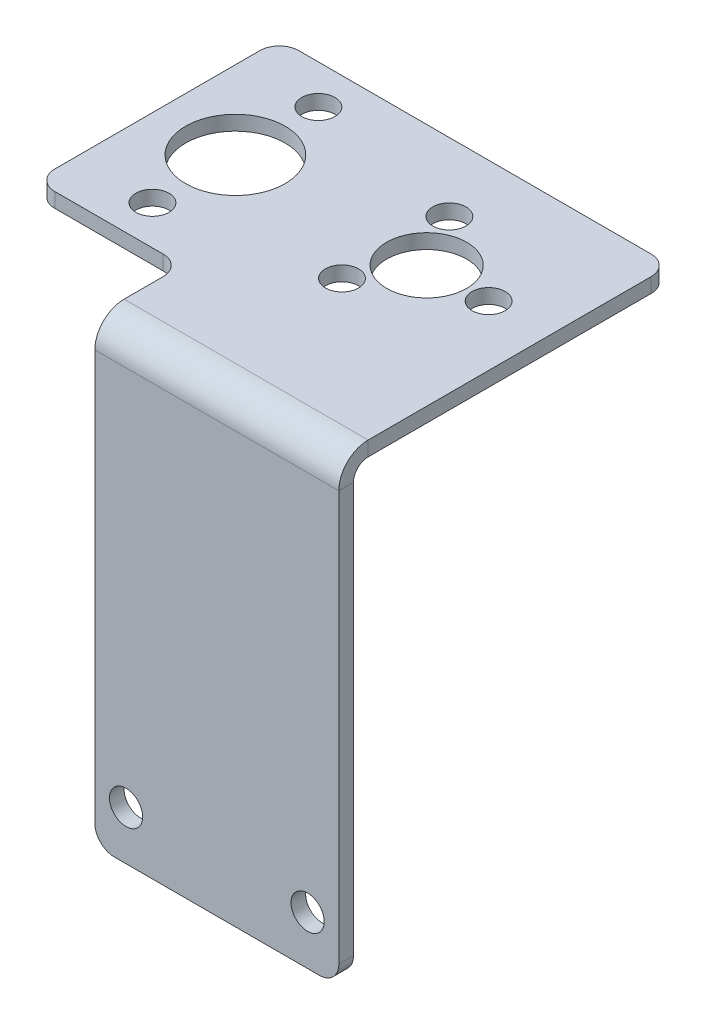
ISO-10303-21;
HEADER;
FILE_DESCRIPTION(('STEP AP214'),'2;1');
FILE_NAME('part.step','',(''),(''),'','','');
FILE_SCHEMA(('AUTOMOTIVE_DESIGN { 1 0 10303 214 1 1 1 1 }'));
ENDSEC;
DATA;
#1=APPLICATION_CONTEXT('core data for automotive mechanical design processes');
#2=APPLICATION_PROTOCOL_DEFINITION('international standard','automotive_design',2000,#1);
#3=PRODUCT_CONTEXT('',#1,'mechanical');
#4=PRODUCT('Part','Part','',(#3));
#5=PRODUCT_RELATED_PRODUCT_CATEGORY('part','',(#4));
#6=PRODUCT_DEFINITION_FORMATION('','',#4);
#7=PRODUCT_DEFINITION_CONTEXT('part definition',#1,'design');
#8=PRODUCT_DEFINITION('design','',#6,#7);
#9=PRODUCT_DEFINITION_SHAPE('','',#8);
#10=(LENGTH_UNIT() NAMED_UNIT(*) SI_UNIT(.MILLI.,.METRE.));
#11=(NAMED_UNIT(*) PLANE_ANGLE_UNIT() SI_UNIT($,.RADIAN.));
#12=(NAMED_UNIT(*) SI_UNIT($,.STERADIAN.) SOLID_ANGLE_UNIT());
#13=UNCERTAINTY_MEASURE_WITH_UNIT(LENGTH_MEASURE(1.E-05),#10,'distance_accuracy_value','');
#14=(GEOMETRIC_REPRESENTATION_CONTEXT(3) GLOBAL_UNCERTAINTY_ASSIGNED_CONTEXT((#13)) GLOBAL_UNIT_ASSIGNED_CONTEXT((#10,
#11,#12)) REPRESENTATION_CONTEXT('',''));
#15=CARTESIAN_POINT('',(0.,0.,0.));
#16=DIRECTION('',(0.,0.,1.));
#17=DIRECTION('',(1.,0.,0.));
#18=AXIS2_PLACEMENT_3D('',#15,#16,#17);
#19=CARTESIAN_POINT('',(0.,-1.5,12.5));
#20=DIRECTION('',(0.,1.,0.));
#21=DIRECTION('',(0.,0.,1.));
#22=AXIS2_PLACEMENT_3D('',#19,#20,#21);
#23=PLANE('',#22);
#24=CARTESIAN_POINT('',(7.99999999999995,-1.5,1.48453871499136E-12));
#25=DIRECTION('',(0.,1.,0.));
#26=DIRECTION('',(0.,0.,1.));
#27=AXIS2_PLACEMENT_3D('',#24,#25,#26);
#28=CIRCLE('',#27,5.1);
#29=CARTESIAN_POINT('',(7.99999999999995,-1.5,5.10000000000149));
#30=VERTEX_POINT('',#29);
#31=EDGE_CURVE('E291',#30,#30,#28,.T.);
#32=ORIENTED_EDGE('',*,*,#31,.T.);
#33=EDGE_LOOP('',(#32));
#34=FACE_BOUND('',#33,.T.);
#35=CARTESIAN_POINT('',(27.597,-1.5,1.51267887105178E-12));
#36=DIRECTION('',(0.,1.,0.));
#37=DIRECTION('',(0.,0.,1.));
#38=AXIS2_PLACEMENT_3D('',#35,#36,#37);
#39=CIRCLE('',#38,4.1);
#40=CARTESIAN_POINT('',(27.597,-1.5,4.10000000000151));
#41=VERTEX_POINT('',#40);
#42=EDGE_CURVE('E300',#41,#41,#39,.T.);
#43=ORIENTED_EDGE('',*,*,#42,.T.);
#44=EDGE_LOOP('',(#43));
#45=FACE_BOUND('',#44,.T.);
#46=CARTESIAN_POINT('',(24.422,-1.5,5.49926131403269));
#47=DIRECTION('',(0.,-1.,0.));
#48=DIRECTION('',(0.,0.,-1.));
#49=AXIS2_PLACEMENT_3D('',#46,#47,#48);
#50=CIRCLE('',#49,1.69999999999999);
#51=CARTESIAN_POINT('',(24.422,-1.5,3.79926131403271));
#52=VERTEX_POINT('',#51);
#53=EDGE_CURVE('E295',#52,#52,#50,.T.);
#54=ORIENTED_EDGE('',*,*,#53,.F.);
#55=EDGE_LOOP('',(#54));
#56=FACE_BOUND('',#55,.T.);
#57=CARTESIAN_POINT('',(33.947,-1.5,1.5204861609582E-12));
#58=DIRECTION('',(0.,-1.,0.));
#59=DIRECTION('',(0.,0.,-1.));
#60=AXIS2_PLACEMENT_3D('',#57,#58,#59);
#61=CIRCLE('',#60,1.69999999999999);
#62=CARTESIAN_POINT('',(33.947,-1.5,-1.69999999999847));
#63=VERTEX_POINT('',#62);
#64=EDGE_CURVE('E314',#63,#63,#61,.T.);
#65=ORIENTED_EDGE('',*,*,#64,.F.);
#66=EDGE_LOOP('',(#65));
#67=FACE_BOUND('',#66,.T.);
#68=CARTESIAN_POINT('',(24.4220000000001,-1.5,-5.49926131402969));
#69=DIRECTION('',(0.,-1.,0.));
#70=DIRECTION('',(0.,0.,-1.));
#71=AXIS2_PLACEMENT_3D('',#68,#69,#70);
#72=CIRCLE('',#71,1.69999999999999);
#73=CARTESIAN_POINT('',(24.4220000000001,-1.5,-7.19926131402968));
#74=VERTEX_POINT('',#73);
#75=EDGE_CURVE('E322',#74,#74,#72,.T.);
#76=ORIENTED_EDGE('',*,*,#75,.F.);
#77=EDGE_LOOP('',(#76));
#78=FACE_BOUND('',#77,.T.);
#79=CARTESIAN_POINT('',(7.99999999999995,-1.5,8.50000000000149));
#80=DIRECTION('',(0.,-1.,0.));
#81=DIRECTION('',(0.,0.,-1.));
#82=AXIS2_PLACEMENT_3D('',#79,#80,#81);
#83=CIRCLE('',#82,1.69999999999999);
#84=CARTESIAN_POINT('',(7.99999999999995,-1.5,6.8000000000015));
#85=VERTEX_POINT('',#84);
#86=EDGE_CURVE('E330',#85,#85,#83,.T.);
#87=ORIENTED_EDGE('',*,*,#86,.F.);
#88=EDGE_LOOP('',(#87));
#89=FACE_BOUND('',#88,.T.);
#90=CARTESIAN_POINT('',(7.99999999999995,-1.5,-8.49999999999852));
#91=DIRECTION('',(0.,-1.,0.));
#92=DIRECTION('',(0.,0.,-1.));
#93=AXIS2_PLACEMENT_3D('',#90,#91,#92);
#94=CIRCLE('',#93,1.69999999999999);
#95=CARTESIAN_POINT('',(7.99999999999995,-1.5,-10.1999999999985));
#96=VERTEX_POINT('',#95);
#97=EDGE_CURVE('E338',#96,#96,#94,.T.);
#98=ORIENTED_EDGE('',*,*,#97,.F.);
#99=EDGE_LOOP('',(#98));
#100=FACE_BOUND('',#99,.T.);
#101=DIRECTION('',(1.,0.,0.));
#102=VECTOR('',#101,1.);
#103=CARTESIAN_POINT('',(0.,-1.5,-12.5));
#104=LINE('',#103,#102);
#105=CARTESIAN_POINT('',(2.,-1.5,-12.5));
#106=VERTEX_POINT('',#105);
#107=CARTESIAN_POINT('',(38.1,-1.5,-12.5));
#108=VERTEX_POINT('',#107);
#109=EDGE_CURVE('E346',#106,#108,#104,.T.);
#110=ORIENTED_EDGE('',*,*,#109,.T.);
#111=CARTESIAN_POINT('',(38.1,-1.5,-10.5));
#112=DIRECTION('',(0.,1.,0.));
#113=DIRECTION('',(0.,0.,1.));
#114=AXIS2_PLACEMENT_3D('',#111,#112,#113);
#115=CIRCLE('',#114,2.);
#116=CARTESIAN_POINT('',(40.1,-1.5,-10.5));
#117=VERTEX_POINT('',#116);
#118=EDGE_CURVE('E394',#108,#117,#115,.F.);
#119=ORIENTED_EDGE('',*,*,#118,.T.);
#120=DIRECTION('',(0.,0.,-1.));
#121=VECTOR('',#120,1.);
#122=CARTESIAN_POINT('',(40.1,-1.5,18.5));
#123=LINE('',#122,#121);
#124=CARTESIAN_POINT('',(40.1,-1.5,18.5));
#125=VERTEX_POINT('',#124);
#126=EDGE_CURVE('E271',#125,#117,#123,.T.);
#127=ORIENTED_EDGE('',*,*,#126,.F.);
#128=DIRECTION('',(-1.,0.,0.));
#129=VECTOR('',#128,1.);
#130=CARTESIAN_POINT('',(15.1,-1.5,18.5));
#131=LINE('',#130,#129);
#132=CARTESIAN_POINT('',(15.1,-1.5,18.5));
#133=VERTEX_POINT('',#132);
#134=EDGE_CURVE('E262',#133,#125,#131,.F.);
#135=ORIENTED_EDGE('',*,*,#134,.F.);
#136=DIRECTION('',(0.,0.,-1.));
#137=VECTOR('',#136,1.);
#138=CARTESIAN_POINT('',(15.1,-1.5,18.5));
#139=LINE('',#138,#137);
#140=CARTESIAN_POINT('',(15.1,-1.5,14.5));
#141=VERTEX_POINT('',#140);
#142=EDGE_CURVE('E283',#133,#141,#139,.T.);
#143=ORIENTED_EDGE('',*,*,#142,.T.);
#144=CARTESIAN_POINT('',(13.1,-1.5,14.5));
#145=DIRECTION('',(0.,1.,0.));
#146=DIRECTION('',(0.,0.,1.));
#147=AXIS2_PLACEMENT_3D('',#144,#145,#146);
#148=CIRCLE('',#147,2.);
#149=CARTESIAN_POINT('',(13.1,-1.5,12.5));
#150=VERTEX_POINT('',#149);
#151=EDGE_CURVE('E13',#141,#150,#148,.T.);
#152=ORIENTED_EDGE('',*,*,#151,.T.);
#153=DIRECTION('',(1.,0.,0.));
#154=VECTOR('',#153,1.);
#155=CARTESIAN_POINT('',(0.,-1.5,12.5));
#156=LINE('',#155,#154);
#157=CARTESIAN_POINT('',(2.,-1.5,12.5));
#158=VERTEX_POINT('',#157);
#159=EDGE_CURVE('E347',#158,#150,#156,.T.);
#160=ORIENTED_EDGE('',*,*,#159,.F.);
#161=CARTESIAN_POINT('',(2.,-1.5,10.5));
#162=DIRECTION('',(0.,1.,0.));
#163=DIRECTION('',(0.,0.,1.));
#164=AXIS2_PLACEMENT_3D('',#161,#162,#163);
#165=CIRCLE('',#164,2.);
#166=CARTESIAN_POINT('',(0.,-1.5,10.5));
#167=VERTEX_POINT('',#166);
#168=EDGE_CURVE('E388',#158,#167,#165,.F.);
#169=ORIENTED_EDGE('',*,*,#168,.T.);
#170=DIRECTION('',(0.,0.,-1.));
#171=VECTOR('',#170,1.);
#172=CARTESIAN_POINT('',(0.,-1.5,12.5));
#173=LINE('',#172,#171);
#174=CARTESIAN_POINT('',(0.,-1.5,-10.5));
#175=VERTEX_POINT('',#174);
#176=EDGE_CURVE('E356',#167,#175,#173,.T.);
#177=ORIENTED_EDGE('',*,*,#176,.T.);
#178=CARTESIAN_POINT('',(2.,-1.5,-10.5));
#179=DIRECTION('',(0.,1.,0.));
#180=DIRECTION('',(0.,0.,1.));
#181=AXIS2_PLACEMENT_3D('',#178,#179,#180);
#182=CIRCLE('',#181,2.);
#183=EDGE_CURVE('E391',#175,#106,#182,.F.);
#184=ORIENTED_EDGE('',*,*,#183,.T.);
#185=EDGE_LOOP('',(#110,#119,#127,#135,#143,#152,#160,#169,#177,#184));
#186=FACE_BOUND('',#185,.T.);
#187=ADVANCED_FACE('F61',(#34,#45,#56,#67,#78,#89,#100,#186),#23,.F.);
#188=CARTESIAN_POINT('',(0.,0.,12.5));
#189=DIRECTION('',(0.,1.,0.));
#190=DIRECTION('',(0.,0.,1.));
#191=AXIS2_PLACEMENT_3D('',#188,#189,#190);
#192=PLANE('',#191);
#193=DIRECTION('',(0.,0.,-1.));
#194=VECTOR('',#193,1.);
#195=CARTESIAN_POINT('',(40.1,0.,18.5));
#196=LINE('',#195,#194);
#197=CARTESIAN_POINT('',(40.1,0.,18.5));
#198=VERTEX_POINT('',#197);
#199=CARTESIAN_POINT('',(40.1,0.,-10.5));
#200=VERTEX_POINT('',#199);
#201=EDGE_CURVE('E275',#198,#200,#196,.T.);
#202=ORIENTED_EDGE('',*,*,#201,.T.);
#203=CARTESIAN_POINT('',(38.1,0.,-10.5));
#204=DIRECTION('',(0.,1.,0.));
#205=DIRECTION('',(0.,0.,1.));
#206=AXIS2_PLACEMENT_3D('',#203,#204,#205);
#207=CIRCLE('',#206,2.);
#208=CARTESIAN_POINT('',(38.1,0.,-12.5));
#209=VERTEX_POINT('',#208);
#210=EDGE_CURVE('E379',#200,#209,#207,.T.);
#211=ORIENTED_EDGE('',*,*,#210,.T.);
#212=DIRECTION('',(1.,0.,0.));
#213=VECTOR('',#212,1.);
#214=CARTESIAN_POINT('',(0.,0.,-12.5));
#215=LINE('',#214,#213);
#216=CARTESIAN_POINT('',(2.,0.,-12.5));
#217=VERTEX_POINT('',#216);
#218=EDGE_CURVE('E352',#217,#209,#215,.T.);
#219=ORIENTED_EDGE('',*,*,#218,.F.);
#220=CARTESIAN_POINT('',(2.,0.,-10.5));
#221=DIRECTION('',(0.,1.,0.));
#222=DIRECTION('',(0.,0.,1.));
#223=AXIS2_PLACEMENT_3D('',#220,#221,#222);
#224=CIRCLE('',#223,2.);
#225=CARTESIAN_POINT('',(0.,0.,-10.5));
#226=VERTEX_POINT('',#225);
#227=EDGE_CURVE('E377',#217,#226,#224,.T.);
#228=ORIENTED_EDGE('',*,*,#227,.T.);
#229=DIRECTION('',(0.,0.,-1.));
#230=VECTOR('',#229,1.);
#231=CARTESIAN_POINT('',(0.,0.,12.5));
#232=LINE('',#231,#230);
#233=CARTESIAN_POINT('',(0.,0.,10.5));
#234=VERTEX_POINT('',#233);
#235=EDGE_CURVE('E366',#234,#226,#232,.T.);
#236=ORIENTED_EDGE('',*,*,#235,.F.);
#237=CARTESIAN_POINT('',(2.,0.,10.5));
#238=DIRECTION('',(0.,1.,0.));
#239=DIRECTION('',(0.,0.,1.));
#240=AXIS2_PLACEMENT_3D('',#237,#238,#239);
#241=CIRCLE('',#240,2.);
#242=CARTESIAN_POINT('',(2.,0.,12.5));
#243=VERTEX_POINT('',#242);
#244=EDGE_CURVE('E374',#234,#243,#241,.T.);
#245=ORIENTED_EDGE('',*,*,#244,.T.);
#246=DIRECTION('',(1.,0.,0.));
#247=VECTOR('',#246,1.);
#248=CARTESIAN_POINT('',(0.,0.,12.5));
#249=LINE('',#248,#247);
#250=CARTESIAN_POINT('',(13.1,0.,12.5));
#251=VERTEX_POINT('',#250);
#252=EDGE_CURVE('E351',#243,#251,#249,.T.);
#253=ORIENTED_EDGE('',*,*,#252,.T.);
#254=CARTESIAN_POINT('',(13.1,0.,14.5));
#255=DIRECTION('',(0.,1.,0.));
#256=DIRECTION('',(0.,0.,1.));
#257=AXIS2_PLACEMENT_3D('',#254,#255,#256);
#258=CIRCLE('',#257,2.);
#259=CARTESIAN_POINT('',(15.1,0.,14.5));
#260=VERTEX_POINT('',#259);
#261=EDGE_CURVE('E71',#251,#260,#258,.F.);
#262=ORIENTED_EDGE('',*,*,#261,.T.);
#263=DIRECTION('',(0.,0.,-1.));
#264=VECTOR('',#263,1.);
#265=CARTESIAN_POINT('',(15.1,0.,18.5));
#266=LINE('',#265,#264);
#267=CARTESIAN_POINT('',(15.1,0.,18.5));
#268=VERTEX_POINT('',#267);
#269=EDGE_CURVE('E279',#268,#260,#266,.T.);
#270=ORIENTED_EDGE('',*,*,#269,.F.);
#271=DIRECTION('',(-1.,0.,0.));
#272=VECTOR('',#271,1.);
#273=CARTESIAN_POINT('',(15.1,0.,18.5));
#274=LINE('',#273,#272);
#275=EDGE_CURVE('E221',#268,#198,#274,.F.);
#276=ORIENTED_EDGE('',*,*,#275,.T.);
#277=EDGE_LOOP('',(#202,#211,#219,#228,#236,#245,#253,#262,#270,#276));
#278=FACE_BOUND('',#277,.T.);
#279=CARTESIAN_POINT('',(7.99999999999995,0.,1.48453871499136E-12));
#280=DIRECTION('',(0.,1.,0.));
#281=DIRECTION('',(0.,0.,1.));
#282=AXIS2_PLACEMENT_3D('',#279,#280,#281);
#283=CIRCLE('',#282,5.1);
#284=CARTESIAN_POINT('',(7.99999999999995,0.,5.10000000000149));
#285=VERTEX_POINT('',#284);
#286=EDGE_CURVE('E296',#285,#285,#283,.T.);
#287=ORIENTED_EDGE('',*,*,#286,.F.);
#288=EDGE_LOOP('',(#287));
#289=FACE_BOUND('',#288,.T.);
#290=CARTESIAN_POINT('',(27.597,0.,1.51267887105178E-12));
#291=DIRECTION('',(0.,1.,0.));
#292=DIRECTION('',(0.,0.,1.));
#293=AXIS2_PLACEMENT_3D('',#290,#291,#292);
#294=CIRCLE('',#293,4.1);
#295=CARTESIAN_POINT('',(27.597,0.,4.10000000000151));
#296=VERTEX_POINT('',#295);
#297=EDGE_CURVE('E287',#296,#296,#294,.T.);
#298=ORIENTED_EDGE('',*,*,#297,.F.);
#299=EDGE_LOOP('',(#298));
#300=FACE_BOUND('',#299,.T.);
#301=CARTESIAN_POINT('',(24.422,0.,5.49926131403269));
#302=DIRECTION('',(0.,-1.,0.));
#303=DIRECTION('',(0.,0.,-1.));
#304=AXIS2_PLACEMENT_3D('',#301,#302,#303);
#305=CIRCLE('',#304,1.7);
#306=CARTESIAN_POINT('',(24.422,0.,3.79926131403269));
#307=VERTEX_POINT('',#306);
#308=EDGE_CURVE('E310',#307,#307,#305,.T.);
#309=ORIENTED_EDGE('',*,*,#308,.T.);
#310=EDGE_LOOP('',(#309));
#311=FACE_BOUND('',#310,.T.);
#312=CARTESIAN_POINT('',(33.947,0.,1.5204861609582E-12));
#313=DIRECTION('',(0.,-1.,0.));
#314=DIRECTION('',(0.,0.,-1.));
#315=AXIS2_PLACEMENT_3D('',#312,#313,#314);
#316=CIRCLE('',#315,1.7);
#317=CARTESIAN_POINT('',(33.947,0.,-1.69999999999848));
#318=VERTEX_POINT('',#317);
#319=EDGE_CURVE('E318',#318,#318,#316,.T.);
#320=ORIENTED_EDGE('',*,*,#319,.T.);
#321=EDGE_LOOP('',(#320));
#322=FACE_BOUND('',#321,.T.);
#323=CARTESIAN_POINT('',(24.4220000000001,0.,-5.49926131402969));
#324=DIRECTION('',(0.,-1.,0.));
#325=DIRECTION('',(0.,0.,-1.));
#326=AXIS2_PLACEMENT_3D('',#323,#324,#325);
#327=CIRCLE('',#326,1.7);
#328=CARTESIAN_POINT('',(24.4220000000001,0.,-7.19926131402969));
#329=VERTEX_POINT('',#328);
#330=EDGE_CURVE('E326',#329,#329,#327,.T.);
#331=ORIENTED_EDGE('',*,*,#330,.T.);
#332=EDGE_LOOP('',(#331));
#333=FACE_BOUND('',#332,.T.);
#334=CARTESIAN_POINT('',(7.99999999999995,0.,8.50000000000149));
#335=DIRECTION('',(0.,-1.,0.));
#336=DIRECTION('',(0.,0.,-1.));
#337=AXIS2_PLACEMENT_3D('',#334,#335,#336);
#338=CIRCLE('',#337,1.7);
#339=CARTESIAN_POINT('',(7.99999999999995,0.,6.80000000000149));
#340=VERTEX_POINT('',#339);
#341=EDGE_CURVE('E334',#340,#340,#338,.T.);
#342=ORIENTED_EDGE('',*,*,#341,.T.);
#343=EDGE_LOOP('',(#342));
#344=FACE_BOUND('',#343,.T.);
#345=CARTESIAN_POINT('',(7.99999999999995,0.,-8.49999999999852));
#346=DIRECTION('',(0.,-1.,0.));
#347=DIRECTION('',(0.,0.,-1.));
#348=AXIS2_PLACEMENT_3D('',#345,#346,#347);
#349=CIRCLE('',#348,1.7);
#350=CARTESIAN_POINT('',(7.99999999999995,0.,-10.1999999999985));
#351=VERTEX_POINT('',#350);
#352=EDGE_CURVE('E342',#351,#351,#349,.T.);
#353=ORIENTED_EDGE('',*,*,#352,.T.);
#354=EDGE_LOOP('',(#353));
#355=FACE_BOUND('',#354,.T.);
#356=ADVANCED_FACE('F440',(#278,#289,#300,#311,#322,#333,#344,#355),#192,.T.);
#357=CARTESIAN_POINT('',(0.,-1.5,12.5));
#358=DIRECTION('',(-1.,0.,0.));
#359=DIRECTION('',(0.,0.,1.));
#360=AXIS2_PLACEMENT_3D('',#357,#358,#359);
#361=PLANE('',#360);
#362=ORIENTED_EDGE('',*,*,#235,.T.);
#363=DIRECTION('',(0.,1.,0.));
#364=VECTOR('',#363,1.);
#365=CARTESIAN_POINT('',(0.,-1.5,-10.5));
#366=LINE('',#365,#364);
#367=EDGE_CURVE('E435',#226,#175,#366,.F.);
#368=ORIENTED_EDGE('',*,*,#367,.T.);
#369=ORIENTED_EDGE('',*,*,#176,.F.);
#370=DIRECTION('',(0.,1.,0.));
#371=VECTOR('',#370,1.);
#372=CARTESIAN_POINT('',(0.,0.,10.5));
#373=LINE('',#372,#371);
#374=EDGE_CURVE('E431',#167,#234,#373,.T.);
#375=ORIENTED_EDGE('',*,*,#374,.T.);
#376=EDGE_LOOP('',(#362,#368,#369,#375));
#377=FACE_BOUND('',#376,.T.);
#378=ADVANCED_FACE('F463',(#377),#361,.T.);
#379=CARTESIAN_POINT('',(0.,0.,12.5));
#380=DIRECTION('',(0.,0.,-1.));
#381=DIRECTION('',(-1.,0.,0.));
#382=AXIS2_PLACEMENT_3D('',#379,#380,#381);
#383=PLANE('',#382);
#384=ORIENTED_EDGE('',*,*,#159,.T.);
#385=DIRECTION('',(0.,1.,0.));
#386=VECTOR('',#385,1.);
#387=CARTESIAN_POINT('',(13.1,0.,12.5));
#388=LINE('',#387,#386);
#389=EDGE_CURVE('E400',#150,#251,#388,.T.);
#390=ORIENTED_EDGE('',*,*,#389,.T.);
#391=ORIENTED_EDGE('',*,*,#252,.F.);
#392=DIRECTION('',(0.,1.,0.));
#393=VECTOR('',#392,1.);
#394=CARTESIAN_POINT('',(2.,-1.5,12.5));
#395=LINE('',#394,#393);
#396=EDGE_CURVE('E397',#243,#158,#395,.F.);
#397=ORIENTED_EDGE('',*,*,#396,.T.);
#398=EDGE_LOOP('',(#384,#390,#391,#397));
#399=FACE_BOUND('',#398,.T.);
#400=ADVANCED_FACE('F456',(#399),#383,.F.);
#401=CARTESIAN_POINT('',(0.,0.,-12.5));
#402=DIRECTION('',(0.,0.,-1.));
#403=DIRECTION('',(-1.,0.,0.));
#404=AXIS2_PLACEMENT_3D('',#401,#402,#403);
#405=PLANE('',#404);
#406=ORIENTED_EDGE('',*,*,#218,.T.);
#407=DIRECTION('',(0.,-1.,0.));
#408=VECTOR('',#407,1.);
#409=CARTESIAN_POINT('',(38.1,0.,-12.5));
#410=LINE('',#409,#408);
#411=EDGE_CURVE('E385',#209,#108,#410,.T.);
#412=ORIENTED_EDGE('',*,*,#411,.T.);
#413=ORIENTED_EDGE('',*,*,#109,.F.);
#414=DIRECTION('',(0.,1.,0.));
#415=VECTOR('',#414,1.);
#416=CARTESIAN_POINT('',(2.,0.,-12.5));
#417=LINE('',#416,#415);
#418=EDGE_CURVE('E382',#106,#217,#417,.T.);
#419=ORIENTED_EDGE('',*,*,#418,.T.);
#420=EDGE_LOOP('',(#406,#412,#413,#419));
#421=FACE_BOUND('',#420,.T.);
#422=ADVANCED_FACE('F472',(#421),#405,.T.);
#423=CARTESIAN_POINT('',(7.99999999999995,-1.5,-8.49999999999852));
#424=DIRECTION('',(0.,-1.,0.));
#425=DIRECTION('',(0.,0.,-1.));
#426=AXIS2_PLACEMENT_3D('',#423,#424,#425);
#427=CYLINDRICAL_SURFACE('',#426,1.69999999999999);
#428=ORIENTED_EDGE('',*,*,#352,.F.);
#429=EDGE_LOOP('',(#428));
#430=FACE_BOUND('',#429,.T.);
#431=ORIENTED_EDGE('',*,*,#97,.T.);
#432=EDGE_LOOP('',(#431));
#433=FACE_BOUND('',#432,.T.);
#434=ADVANCED_FACE('F769',(#430,#433),#427,.F.);
#435=CARTESIAN_POINT('',(7.99999999999995,-1.5,8.50000000000149));
#436=DIRECTION('',(0.,-1.,0.));
#437=DIRECTION('',(0.,0.,-1.));
#438=AXIS2_PLACEMENT_3D('',#435,#436,#437);
#439=CYLINDRICAL_SURFACE('',#438,1.69999999999999);
#440=ORIENTED_EDGE('',*,*,#341,.F.);
#441=EDGE_LOOP('',(#440));
#442=FACE_BOUND('',#441,.T.);
#443=ORIENTED_EDGE('',*,*,#86,.T.);
#444=EDGE_LOOP('',(#443));
#445=FACE_BOUND('',#444,.T.);
#446=ADVANCED_FACE('F759',(#442,#445),#439,.F.);
#447=CARTESIAN_POINT('',(24.4220000000001,-1.5,-5.49926131402969));
#448=DIRECTION('',(0.,-1.,0.));
#449=DIRECTION('',(0.,0.,-1.));
#450=AXIS2_PLACEMENT_3D('',#447,#448,#449);
#451=CYLINDRICAL_SURFACE('',#450,1.69999999999999);
#452=ORIENTED_EDGE('',*,*,#330,.F.);
#453=EDGE_LOOP('',(#452));
#454=FACE_BOUND('',#453,.T.);
#455=ORIENTED_EDGE('',*,*,#75,.T.);
#456=EDGE_LOOP('',(#455));
#457=FACE_BOUND('',#456,.T.);
#458=ADVANCED_FACE('F749',(#454,#457),#451,.F.);
#459=CARTESIAN_POINT('',(33.947,-1.5,1.5204861609582E-12));
#460=DIRECTION('',(0.,-1.,0.));
#461=DIRECTION('',(0.,0.,-1.));
#462=AXIS2_PLACEMENT_3D('',#459,#460,#461);
#463=CYLINDRICAL_SURFACE('',#462,1.69999999999999);
#464=ORIENTED_EDGE('',*,*,#319,.F.);
#465=EDGE_LOOP('',(#464));
#466=FACE_BOUND('',#465,.T.);
#467=ORIENTED_EDGE('',*,*,#64,.T.);
#468=EDGE_LOOP('',(#467));
#469=FACE_BOUND('',#468,.T.);
#470=ADVANCED_FACE('F739',(#466,#469),#463,.F.);
#471=CARTESIAN_POINT('',(24.422,-1.5,5.49926131403269));
#472=DIRECTION('',(0.,-1.,0.));
#473=DIRECTION('',(0.,0.,-1.));
#474=AXIS2_PLACEMENT_3D('',#471,#472,#473);
#475=CYLINDRICAL_SURFACE('',#474,1.69999999999999);
#476=ORIENTED_EDGE('',*,*,#308,.F.);
#477=EDGE_LOOP('',(#476));
#478=FACE_BOUND('',#477,.T.);
#479=ORIENTED_EDGE('',*,*,#53,.T.);
#480=EDGE_LOOP('',(#479));
#481=FACE_BOUND('',#480,.T.);
#482=ADVANCED_FACE('F728',(#478,#481),#475,.F.);
#483=CARTESIAN_POINT('',(27.597,-1.5,1.51267887105178E-12));
#484=DIRECTION('',(0.,1.,0.));
#485=DIRECTION('',(0.,0.,1.));
#486=AXIS2_PLACEMENT_3D('',#483,#484,#485);
#487=CYLINDRICAL_SURFACE('',#486,4.1);
#488=ORIENTED_EDGE('',*,*,#42,.F.);
#489=EDGE_LOOP('',(#488));
#490=FACE_BOUND('',#489,.T.);
#491=ORIENTED_EDGE('',*,*,#297,.T.);
#492=EDGE_LOOP('',(#491));
#493=FACE_BOUND('',#492,.T.);
#494=ADVANCED_FACE('F716',(#490,#493),#487,.F.);
#495=CARTESIAN_POINT('',(7.99999999999995,-1.5,1.48453871499136E-12));
#496=DIRECTION('',(0.,1.,0.));
#497=DIRECTION('',(0.,0.,1.));
#498=AXIS2_PLACEMENT_3D('',#495,#496,#497);
#499=CYLINDRICAL_SURFACE('',#498,5.1);
#500=ORIENTED_EDGE('',*,*,#31,.F.);
#501=EDGE_LOOP('',(#500));
#502=FACE_BOUND('',#501,.T.);
#503=ORIENTED_EDGE('',*,*,#286,.T.);
#504=EDGE_LOOP('',(#503));
#505=FACE_BOUND('',#504,.T.);
#506=ADVANCED_FACE('F711',(#502,#505),#499,.F.);
#507=CARTESIAN_POINT('',(15.1,-1.5,18.5));
#508=DIRECTION('',(-1.,0.,0.));
#509=DIRECTION('',(0.,1.,0.));
#510=AXIS2_PLACEMENT_3D('',#507,#508,#509);
#511=PLANE('',#510);
#512=ORIENTED_EDGE('',*,*,#269,.T.);
#513=DIRECTION('',(0.,1.,0.));
#514=VECTOR('',#513,1.);
#515=CARTESIAN_POINT('',(15.1,-1.5,14.5));
#516=LINE('',#515,#514);
#517=EDGE_CURVE('E404',#260,#141,#516,.F.);
#518=ORIENTED_EDGE('',*,*,#517,.T.);
#519=ORIENTED_EDGE('',*,*,#142,.F.);
#520=DIRECTION('',(0.,1.,0.));
#521=VECTOR('',#520,1.);
#522=CARTESIAN_POINT('',(15.1,-1.5,18.5));
#523=LINE('',#522,#521);
#524=EDGE_CURVE('E257',#133,#268,#523,.T.);
#525=ORIENTED_EDGE('',*,*,#524,.T.);
#526=EDGE_LOOP('',(#512,#518,#519,#525));
#527=FACE_BOUND('',#526,.T.);
#528=ADVANCED_FACE('F447',(#527),#511,.T.);
#529=CARTESIAN_POINT('',(40.1,-1.5,18.5));
#530=DIRECTION('',(-1.,0.,0.));
#531=DIRECTION('',(0.,1.,0.));
#532=AXIS2_PLACEMENT_3D('',#529,#530,#531);
#533=PLANE('',#532);
#534=ORIENTED_EDGE('',*,*,#126,.T.);
#535=DIRECTION('',(0.,1.,0.));
#536=VECTOR('',#535,1.);
#537=CARTESIAN_POINT('',(40.1,-1.5,-10.5));
#538=LINE('',#537,#536);
#539=EDGE_CURVE('E370',#117,#200,#538,.T.);
#540=ORIENTED_EDGE('',*,*,#539,.T.);
#541=ORIENTED_EDGE('',*,*,#201,.F.);
#542=DIRECTION('',(0.,1.,0.));
#543=VECTOR('',#542,1.);
#544=CARTESIAN_POINT('',(40.1,-1.5,18.5));
#545=LINE('',#544,#543);
#546=EDGE_CURVE('E267',#125,#198,#545,.T.);
#547=ORIENTED_EDGE('',*,*,#546,.F.);
#548=EDGE_LOOP('',(#534,#540,#541,#547));
#549=FACE_BOUND('',#548,.T.);
#550=ADVANCED_FACE('F481',(#549),#533,.F.);
#551=CARTESIAN_POINT('',(40.1,-2.99999999999999,18.5));
#552=DIRECTION('',(1.,0.,0.));
#553=DIRECTION('',(0.,0.,-1.));
#554=AXIS2_PLACEMENT_3D('',#551,#552,#553);
#555=PLANE('',#554);
#556=DIRECTION('',(0.,0.,1.));
#557=VECTOR('',#556,1.);
#558=CARTESIAN_POINT('',(40.1,-3.,21.5000000000002));
#559=LINE('',#558,#557);
#560=CARTESIAN_POINT('',(40.1,-2.99999999999999,20.));
#561=VERTEX_POINT('',#560);
#562=CARTESIAN_POINT('',(40.1,-2.99999999999998,21.5));
#563=VERTEX_POINT('',#562);
#564=EDGE_CURVE('E249',#561,#563,#559,.T.);
#565=ORIENTED_EDGE('',*,*,#564,.F.);
#566=CARTESIAN_POINT('',(40.1,-2.99999999999999,18.5));
#567=DIRECTION('',(-1.,0.,0.));
#568=DIRECTION('',(0.,0.,1.));
#569=AXIS2_PLACEMENT_3D('',#566,#567,#568);
#570=CIRCLE('',#569,1.5);
#571=EDGE_CURVE('E225',#125,#561,#570,.F.);
#572=ORIENTED_EDGE('',*,*,#571,.F.);
#573=ORIENTED_EDGE('',*,*,#546,.T.);
#574=CARTESIAN_POINT('',(40.1,-2.99999999999999,18.5));
#575=DIRECTION('',(-1.,0.,0.));
#576=DIRECTION('',(0.,0.,1.));
#577=AXIS2_PLACEMENT_3D('',#574,#575,#576);
#578=CIRCLE('',#577,3.);
#579=EDGE_CURVE('E255',#198,#563,#578,.F.);
#580=ORIENTED_EDGE('',*,*,#579,.T.);
#581=EDGE_LOOP('',(#565,#572,#573,#580));
#582=FACE_BOUND('',#581,.T.);
#583=ADVANCED_FACE('F485',(#582),#555,.T.);
#584=CARTESIAN_POINT('',(15.1,-2.99999999999999,18.5));
#585=DIRECTION('',(1.,0.,0.));
#586=DIRECTION('',(0.,0.,-1.));
#587=AXIS2_PLACEMENT_3D('',#584,#585,#586);
#588=PLANE('',#587);
#589=CARTESIAN_POINT('',(15.1,-2.99999999999999,18.5));
#590=DIRECTION('',(-1.,0.,0.));
#591=DIRECTION('',(0.,0.,1.));
#592=AXIS2_PLACEMENT_3D('',#589,#590,#591);
#593=CIRCLE('',#592,1.5);
#594=CARTESIAN_POINT('',(15.1,-2.99999999999999,20.));
#595=VERTEX_POINT('',#594);
#596=EDGE_CURVE('E211',#595,#133,#593,.T.);
#597=ORIENTED_EDGE('',*,*,#596,.F.);
#598=DIRECTION('',(0.,0.,1.));
#599=VECTOR('',#598,1.);
#600=CARTESIAN_POINT('',(15.1,-2.99999999999999,20.));
#601=LINE('',#600,#599);
#602=CARTESIAN_POINT('',(15.1,-2.99999999999999,21.5));
#603=VERTEX_POINT('',#602);
#604=EDGE_CURVE('E208',#595,#603,#601,.T.);
#605=ORIENTED_EDGE('',*,*,#604,.T.);
#606=CARTESIAN_POINT('',(15.1,-2.99999999999999,18.5));
#607=DIRECTION('',(-1.,0.,0.));
#608=DIRECTION('',(0.,0.,1.));
#609=AXIS2_PLACEMENT_3D('',#606,#607,#608);
#610=CIRCLE('',#609,3.);
#611=EDGE_CURVE('E216',#603,#268,#610,.T.);
#612=ORIENTED_EDGE('',*,*,#611,.T.);
#613=ORIENTED_EDGE('',*,*,#524,.F.);
#614=EDGE_LOOP('',(#597,#605,#612,#613));
#615=FACE_BOUND('',#614,.T.);
#616=ADVANCED_FACE('F228',(#615),#588,.F.);
#617=CARTESIAN_POINT('',(15.1,-2.99999999999999,18.5));
#618=DIRECTION('',(-1.,0.,0.));
#619=DIRECTION('',(0.,0.,1.));
#620=AXIS2_PLACEMENT_3D('',#617,#618,#619);
#621=CYLINDRICAL_SURFACE('',#620,3.);
#622=ORIENTED_EDGE('',*,*,#275,.F.);
#623=ORIENTED_EDGE('',*,*,#611,.F.);
#624=DIRECTION('',(-1.,0.,0.));
#625=VECTOR('',#624,1.);
#626=CARTESIAN_POINT('',(0.,-2.99999999999999,21.5));
#627=LINE('',#626,#625);
#628=EDGE_CURVE('E218',#563,#603,#627,.T.);
#629=ORIENTED_EDGE('',*,*,#628,.F.);
#630=ORIENTED_EDGE('',*,*,#579,.F.);
#631=EDGE_LOOP('',(#622,#623,#629,#630));
#632=FACE_BOUND('',#631,.T.);
#633=ADVANCED_FACE('F217',(#632),#621,.T.);
#634=CARTESIAN_POINT('',(15.1,-2.99999999999999,18.5));
#635=DIRECTION('',(-1.,0.,0.));
#636=DIRECTION('',(0.,0.,1.));
#637=AXIS2_PLACEMENT_3D('',#634,#635,#636);
#638=CYLINDRICAL_SURFACE('',#637,1.5);
#639=ORIENTED_EDGE('',*,*,#134,.T.);
#640=ORIENTED_EDGE('',*,*,#571,.T.);
#641=DIRECTION('',(1.,0.,0.));
#642=VECTOR('',#641,1.);
#643=CARTESIAN_POINT('',(40.1,-2.99999999999999,20.));
#644=LINE('',#643,#642);
#645=EDGE_CURVE('E231',#561,#595,#644,.F.);
#646=ORIENTED_EDGE('',*,*,#645,.T.);
#647=ORIENTED_EDGE('',*,*,#596,.T.);
#648=EDGE_LOOP('',(#639,#640,#646,#647));
#649=FACE_BOUND('',#648,.T.);
#650=ADVANCED_FACE('F488',(#649),#638,.F.);
#651=CARTESIAN_POINT('',(15.1,-1.49999999999999,21.5));
#652=DIRECTION('',(-1.,0.,0.));
#653=DIRECTION('',(0.,0.,1.));
#654=AXIS2_PLACEMENT_3D('',#651,#652,#653);
#655=PLANE('',#654);
#656=DIRECTION('',(0.,-1.,0.));
#657=VECTOR('',#656,1.);
#658=CARTESIAN_POINT('',(15.1,0.,20.));
#659=LINE('',#658,#657);
#660=CARTESIAN_POINT('',(15.1,-45.,20.0000000000001));
#661=VERTEX_POINT('',#660);
#662=EDGE_CURVE('E492',#661,#595,#659,.F.);
#663=ORIENTED_EDGE('',*,*,#662,.F.);
#664=DIRECTION('',(0.,0.,-1.));
#665=VECTOR('',#664,1.);
#666=CARTESIAN_POINT('',(15.1,-45.,21.5000000000001));
#667=LINE('',#666,#665);
#668=CARTESIAN_POINT('',(15.1,-45.,21.5000000000001));
#669=VERTEX_POINT('',#668);
#670=EDGE_CURVE('E81',#661,#669,#667,.F.);
#671=ORIENTED_EDGE('',*,*,#670,.T.);
#672=DIRECTION('',(0.,1.,0.));
#673=VECTOR('',#672,1.);
#674=CARTESIAN_POINT('',(15.1,-1.49999999999999,21.5));
#675=LINE('',#674,#673);
#676=EDGE_CURVE('E204',#669,#603,#675,.T.);
#677=ORIENTED_EDGE('',*,*,#676,.T.);
#678=ORIENTED_EDGE('',*,*,#604,.F.);
#679=EDGE_LOOP('',(#663,#671,#677,#678));
#680=FACE_BOUND('',#679,.T.);
#681=ADVANCED_FACE('F206',(#680),#655,.T.);
#682=CARTESIAN_POINT('',(40.1,-47.,21.5000000000002));
#683=DIRECTION('',(1.,0.,0.));
#684=DIRECTION('',(0.,1.,0.));
#685=AXIS2_PLACEMENT_3D('',#682,#683,#684);
#686=PLANE('',#685);
#687=DIRECTION('',(0.,-1.,0.));
#688=VECTOR('',#687,1.);
#689=CARTESIAN_POINT('',(40.1,-47.,21.5000000000002));
#690=LINE('',#689,#688);
#691=CARTESIAN_POINT('',(40.1,-45.,21.5000000000001));
#692=VERTEX_POINT('',#691);
#693=EDGE_CURVE('E236',#563,#692,#690,.T.);
#694=ORIENTED_EDGE('',*,*,#693,.T.);
#695=DIRECTION('',(0.,0.,-1.));
#696=VECTOR('',#695,1.);
#697=CARTESIAN_POINT('',(40.1,-45.,21.5000000000001));
#698=LINE('',#697,#696);
#699=CARTESIAN_POINT('',(40.1,-45.,20.0000000000001));
#700=VERTEX_POINT('',#699);
#701=EDGE_CURVE('E407',#692,#700,#698,.T.);
#702=ORIENTED_EDGE('',*,*,#701,.T.);
#703=DIRECTION('',(0.,1.,0.));
#704=VECTOR('',#703,1.);
#705=CARTESIAN_POINT('',(40.1,0.,20.));
#706=LINE('',#705,#704);
#707=EDGE_CURVE('E238',#561,#700,#706,.F.);
#708=ORIENTED_EDGE('',*,*,#707,.F.);
#709=ORIENTED_EDGE('',*,*,#564,.T.);
#710=EDGE_LOOP('',(#694,#702,#708,#709));
#711=FACE_BOUND('',#710,.T.);
#712=ADVANCED_FACE('F494',(#711),#686,.T.);
#713=CARTESIAN_POINT('',(0.,0.,21.5));
#714=DIRECTION('',(0.,0.,1.));
#715=DIRECTION('',(0.,-1.,0.));
#716=AXIS2_PLACEMENT_3D('',#713,#714,#715);
#717=PLANE('',#716);
#718=CARTESIAN_POINT('',(36.9,-42.0000000000003,21.5));
#719=DIRECTION('',(0.,0.,1.));
#720=DIRECTION('',(1.,0.,0.));
#721=AXIS2_PLACEMENT_3D('',#718,#719,#720);
#722=CIRCLE('',#721,1.69999999999999);
#723=CARTESIAN_POINT('',(38.5999999999999,-42.0000000000003,21.5));
#724=VERTEX_POINT('',#723);
#725=EDGE_CURVE('E521',#724,#724,#722,.T.);
#726=ORIENTED_EDGE('',*,*,#725,.F.);
#727=EDGE_LOOP('',(#726));
#728=FACE_BOUND('',#727,.T.);
#729=CARTESIAN_POINT('',(18.3,-42.0000000000003,21.5));
#730=DIRECTION('',(0.,0.,1.));
#731=DIRECTION('',(1.,0.,0.));
#732=AXIS2_PLACEMENT_3D('',#729,#730,#731);
#733=CIRCLE('',#732,1.69999999999999);
#734=CARTESIAN_POINT('',(19.9999999999999,-42.0000000000003,21.5));
#735=VERTEX_POINT('',#734);
#736=EDGE_CURVE('E513',#735,#735,#733,.T.);
#737=ORIENTED_EDGE('',*,*,#736,.F.);
#738=EDGE_LOOP('',(#737));
#739=FACE_BOUND('',#738,.T.);
#740=DIRECTION('',(-1.,0.,0.));
#741=VECTOR('',#740,1.);
#742=CARTESIAN_POINT('',(15.1,-47.,21.5000000000002));
#743=LINE('',#742,#741);
#744=CARTESIAN_POINT('',(38.1,-47.,21.5000000000002));
#745=VERTEX_POINT('',#744);
#746=CARTESIAN_POINT('',(17.1,-47.,21.5000000000002));
#747=VERTEX_POINT('',#746);
#748=EDGE_CURVE('E212',#745,#747,#743,.T.);
#749=ORIENTED_EDGE('',*,*,#748,.F.);
#750=CARTESIAN_POINT('',(38.1,-45.,21.5000000000001));
#751=DIRECTION('',(0.,0.,1.));
#752=DIRECTION('',(0.,-1.,0.));
#753=AXIS2_PLACEMENT_3D('',#750,#751,#752);
#754=CIRCLE('',#753,2.);
#755=EDGE_CURVE('E426',#745,#692,#754,.T.);
#756=ORIENTED_EDGE('',*,*,#755,.T.);
#757=ORIENTED_EDGE('',*,*,#693,.F.);
#758=ORIENTED_EDGE('',*,*,#628,.T.);
#759=ORIENTED_EDGE('',*,*,#676,.F.);
#760=CARTESIAN_POINT('',(17.1,-45.,21.5000000000001));
#761=DIRECTION('',(0.,0.,1.));
#762=DIRECTION('',(0.,-1.,0.));
#763=AXIS2_PLACEMENT_3D('',#760,#761,#762);
#764=CIRCLE('',#763,2.);
#765=EDGE_CURVE('E89',#669,#747,#764,.T.);
#766=ORIENTED_EDGE('',*,*,#765,.T.);
#767=EDGE_LOOP('',(#749,#756,#757,#758,#759,#766));
#768=FACE_BOUND('',#767,.T.);
#769=ADVANCED_FACE('F234',(#728,#739,#768),#717,.T.);
#770=CARTESIAN_POINT('',(0.,0.,20.));
#771=DIRECTION('',(0.,0.,1.));
#772=DIRECTION('',(0.,-1.,0.));
#773=AXIS2_PLACEMENT_3D('',#770,#771,#772);
#774=PLANE('',#773);
#775=CARTESIAN_POINT('',(36.9,-42.0000000000003,20.0000000000001));
#776=DIRECTION('',(0.,0.,1.));
#777=DIRECTION('',(0.,-1.,0.));
#778=AXIS2_PLACEMENT_3D('',#775,#776,#777);
#779=CIRCLE('',#778,1.69999999999999);
#780=CARTESIAN_POINT('',(36.9,-43.7000000000003,20.0000000000001));
#781=VERTEX_POINT('',#780);
#782=EDGE_CURVE('E517',#781,#781,#779,.T.);
#783=ORIENTED_EDGE('',*,*,#782,.T.);
#784=EDGE_LOOP('',(#783));
#785=FACE_BOUND('',#784,.T.);
#786=CARTESIAN_POINT('',(18.3,-42.0000000000003,20.0000000000001));
#787=DIRECTION('',(0.,0.,1.));
#788=DIRECTION('',(0.,-1.,0.));
#789=AXIS2_PLACEMENT_3D('',#786,#787,#788);
#790=CIRCLE('',#789,1.69999999999999);
#791=CARTESIAN_POINT('',(18.3,-43.7000000000003,20.0000000000001));
#792=VERTEX_POINT('',#791);
#793=EDGE_CURVE('E65',#792,#792,#790,.T.);
#794=ORIENTED_EDGE('',*,*,#793,.T.);
#795=EDGE_LOOP('',(#794));
#796=FACE_BOUND('',#795,.T.);
#797=ORIENTED_EDGE('',*,*,#707,.T.);
#798=CARTESIAN_POINT('',(38.1,-45.,20.0000000000001));
#799=DIRECTION('',(0.,0.,1.));
#800=DIRECTION('',(0.,-1.,0.));
#801=AXIS2_PLACEMENT_3D('',#798,#799,#800);
#802=CIRCLE('',#801,2.);
#803=CARTESIAN_POINT('',(38.1,-47.,20.0000000000002));
#804=VERTEX_POINT('',#803);
#805=EDGE_CURVE('E414',#700,#804,#802,.F.);
#806=ORIENTED_EDGE('',*,*,#805,.T.);
#807=DIRECTION('',(1.,0.,0.));
#808=VECTOR('',#807,1.);
#809=CARTESIAN_POINT('',(0.,-47.,20.0000000000002));
#810=LINE('',#809,#808);
#811=CARTESIAN_POINT('',(17.1,-47.,20.0000000000002));
#812=VERTEX_POINT('',#811);
#813=EDGE_CURVE('E243',#804,#812,#810,.F.);
#814=ORIENTED_EDGE('',*,*,#813,.T.);
#815=CARTESIAN_POINT('',(17.1,-45.,20.0000000000001));
#816=DIRECTION('',(0.,0.,1.));
#817=DIRECTION('',(0.,-1.,0.));
#818=AXIS2_PLACEMENT_3D('',#815,#816,#817);
#819=CIRCLE('',#818,2.);
#820=EDGE_CURVE('E411',#812,#661,#819,.F.);
#821=ORIENTED_EDGE('',*,*,#820,.T.);
#822=ORIENTED_EDGE('',*,*,#662,.T.);
#823=ORIENTED_EDGE('',*,*,#645,.F.);
#824=EDGE_LOOP('',(#797,#806,#814,#821,#822,#823));
#825=FACE_BOUND('',#824,.T.);
#826=ADVANCED_FACE('F491',(#785,#796,#825),#774,.F.);
#827=CARTESIAN_POINT('',(15.1,-47.,21.5000000000002));
#828=DIRECTION('',(0.,-1.,0.));
#829=DIRECTION('',(0.,0.,-1.));
#830=AXIS2_PLACEMENT_3D('',#827,#828,#829);
#831=PLANE('',#830);
#832=ORIENTED_EDGE('',*,*,#813,.F.);
#833=DIRECTION('',(0.,0.,-1.));
#834=VECTOR('',#833,1.);
#835=CARTESIAN_POINT('',(38.1,-47.,21.5000000000002));
#836=LINE('',#835,#834);
#837=EDGE_CURVE('E421',#804,#745,#836,.F.);
#838=ORIENTED_EDGE('',*,*,#837,.T.);
#839=ORIENTED_EDGE('',*,*,#748,.T.);
#840=DIRECTION('',(0.,0.,-1.));
#841=VECTOR('',#840,1.);
#842=CARTESIAN_POINT('',(17.1,-47.,21.5000000000002));
#843=LINE('',#842,#841);
#844=EDGE_CURVE('E417',#747,#812,#843,.T.);
#845=ORIENTED_EDGE('',*,*,#844,.T.);
#846=EDGE_LOOP('',(#832,#838,#839,#845));
#847=FACE_BOUND('',#846,.T.);
#848=ADVANCED_FACE('F503',(#847),#831,.T.);
#849=CARTESIAN_POINT('',(38.1,-1.5,-10.5));
#850=DIRECTION('',(0.,-1.,0.));
#851=DIRECTION('',(0.,0.,-1.));
#852=AXIS2_PLACEMENT_3D('',#849,#850,#851);
#853=CYLINDRICAL_SURFACE('',#852,2.);
#854=ORIENTED_EDGE('',*,*,#118,.F.);
#855=ORIENTED_EDGE('',*,*,#411,.F.);
#856=ORIENTED_EDGE('',*,*,#210,.F.);
#857=ORIENTED_EDGE('',*,*,#539,.F.);
#858=EDGE_LOOP('',(#854,#855,#856,#857));
#859=FACE_BOUND('',#858,.T.);
#860=ADVANCED_FACE('F476',(#859),#853,.T.);
#861=CARTESIAN_POINT('',(13.1,0.,14.5));
#862=DIRECTION('',(0.,1.,0.));
#863=DIRECTION('',(0.,0.,1.));
#864=AXIS2_PLACEMENT_3D('',#861,#862,#863);
#865=CYLINDRICAL_SURFACE('',#864,2.);
#866=ORIENTED_EDGE('',*,*,#151,.F.);
#867=ORIENTED_EDGE('',*,*,#517,.F.);
#868=ORIENTED_EDGE('',*,*,#261,.F.);
#869=ORIENTED_EDGE('',*,*,#389,.F.);
#870=EDGE_LOOP('',(#866,#867,#868,#869));
#871=FACE_BOUND('',#870,.T.);
#872=ADVANCED_FACE('F450',(#871),#865,.F.);
#873=CARTESIAN_POINT('',(38.1,-45.,21.5000000000001));
#874=DIRECTION('',(0.,0.,-1.));
#875=DIRECTION('',(0.,1.,0.));
#876=AXIS2_PLACEMENT_3D('',#873,#874,#875);
#877=CYLINDRICAL_SURFACE('',#876,2.);
#878=ORIENTED_EDGE('',*,*,#755,.F.);
#879=ORIENTED_EDGE('',*,*,#837,.F.);
#880=ORIENTED_EDGE('',*,*,#805,.F.);
#881=ORIENTED_EDGE('',*,*,#701,.F.);
#882=EDGE_LOOP('',(#878,#879,#880,#881));
#883=FACE_BOUND('',#882,.T.);
#884=ADVANCED_FACE('F498',(#883),#877,.T.);
#885=CARTESIAN_POINT('',(17.1,-45.,21.5000000000001));
#886=DIRECTION('',(0.,0.,-1.));
#887=DIRECTION('',(0.,1.,0.));
#888=AXIS2_PLACEMENT_3D('',#885,#886,#887);
#889=CYLINDRICAL_SURFACE('',#888,2.);
#890=ORIENTED_EDGE('',*,*,#765,.F.);
#891=ORIENTED_EDGE('',*,*,#670,.F.);
#892=ORIENTED_EDGE('',*,*,#820,.F.);
#893=ORIENTED_EDGE('',*,*,#844,.F.);
#894=EDGE_LOOP('',(#890,#891,#892,#893));
#895=FACE_BOUND('',#894,.T.);
#896=ADVANCED_FACE('F566',(#895),#889,.T.);
#897=CARTESIAN_POINT('',(2.,0.,-10.5));
#898=DIRECTION('',(0.,1.,0.));
#899=DIRECTION('',(0.,0.,1.));
#900=AXIS2_PLACEMENT_3D('',#897,#898,#899);
#901=CYLINDRICAL_SURFACE('',#900,2.);
#902=ORIENTED_EDGE('',*,*,#183,.F.);
#903=ORIENTED_EDGE('',*,*,#367,.F.);
#904=ORIENTED_EDGE('',*,*,#227,.F.);
#905=ORIENTED_EDGE('',*,*,#418,.F.);
#906=EDGE_LOOP('',(#902,#903,#904,#905));
#907=FACE_BOUND('',#906,.T.);
#908=ADVANCED_FACE('F467',(#907),#901,.T.);
#909=CARTESIAN_POINT('',(2.,-1.5,10.5));
#910=DIRECTION('',(0.,-1.,0.));
#911=DIRECTION('',(0.,0.,-1.));
#912=AXIS2_PLACEMENT_3D('',#909,#910,#911);
#913=CYLINDRICAL_SURFACE('',#912,2.);
#914=ORIENTED_EDGE('',*,*,#168,.F.);
#915=ORIENTED_EDGE('',*,*,#396,.F.);
#916=ORIENTED_EDGE('',*,*,#244,.F.);
#917=ORIENTED_EDGE('',*,*,#374,.F.);
#918=EDGE_LOOP('',(#914,#915,#916,#917));
#919=FACE_BOUND('',#918,.T.);
#920=ADVANCED_FACE('F63',(#919),#913,.T.);
#921=CARTESIAN_POINT('',(18.3,-42.0000000000003,21.5));
#922=DIRECTION('',(0.,0.,1.));
#923=DIRECTION('',(1.,0.,0.));
#924=AXIS2_PLACEMENT_3D('',#921,#922,#923);
#925=CYLINDRICAL_SURFACE('',#924,1.69999999999999);
#926=ORIENTED_EDGE('',*,*,#736,.T.);
#927=EDGE_LOOP('',(#926));
#928=FACE_BOUND('',#927,.T.);
#929=ORIENTED_EDGE('',*,*,#793,.F.);
#930=EDGE_LOOP('',(#929));
#931=FACE_BOUND('',#930,.T.);
#932=ADVANCED_FACE('F534',(#928,#931),#925,.F.);
#933=CARTESIAN_POINT('',(36.9,-42.0000000000003,21.5));
#934=DIRECTION('',(0.,0.,1.));
#935=DIRECTION('',(1.,0.,0.));
#936=AXIS2_PLACEMENT_3D('',#933,#934,#935);
#937=CYLINDRICAL_SURFACE('',#936,1.69999999999999);
#938=ORIENTED_EDGE('',*,*,#725,.T.);
#939=EDGE_LOOP('',(#938));
#940=FACE_BOUND('',#939,.T.);
#941=ORIENTED_EDGE('',*,*,#782,.F.);
#942=EDGE_LOOP('',(#941));
#943=FACE_BOUND('',#942,.T.);
#944=ADVANCED_FACE('F526',(#940,#943),#937,.F.);
#945=CLOSED_SHELL('',(#187,#356,#378,#400,#422,#434,#446,#458,#470,#482,#494,#506,#528,#550,
#583,#616,#633,#650,#681,#712,#769,#826,#848,#860,#872,#884,#896,#908,#920,#932,#944));
#946=MANIFOLD_SOLID_BREP('B2',#945);
#947=ADVANCED_BREP_SHAPE_REPRESENTATION('',(#18,#946),#14);
#948=SHAPE_DEFINITION_REPRESENTATION(#9,#947);
ENDSEC;
END-ISO-10303-21;
